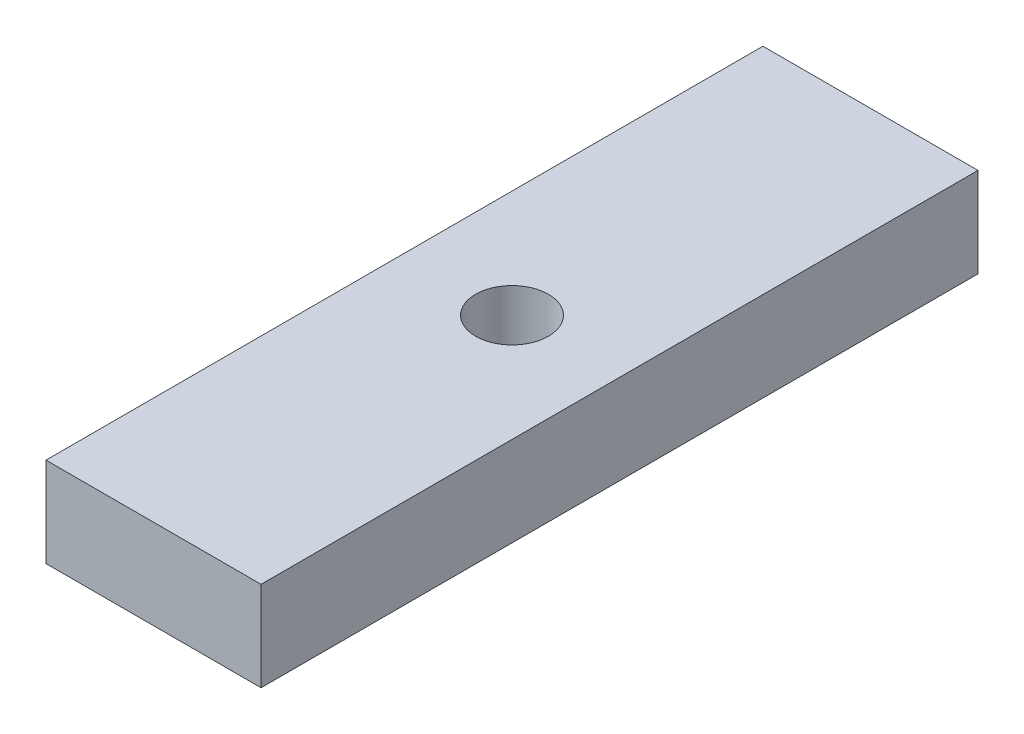
ISO-10303-21;
HEADER;
FILE_DESCRIPTION(('STEP AP214'),'2;1');
FILE_NAME('part.step','',(''),(''),'','','');
FILE_SCHEMA(('AUTOMOTIVE_DESIGN { 1 0 10303 214 1 1 1 1 }'));
ENDSEC;
DATA;
#1=APPLICATION_CONTEXT('core data for automotive mechanical design processes');
#2=APPLICATION_PROTOCOL_DEFINITION('international standard','automotive_design',2000,#1);
#3=PRODUCT_CONTEXT('',#1,'mechanical');
#4=PRODUCT('Part','Part','',(#3));
#5=PRODUCT_RELATED_PRODUCT_CATEGORY('part','',(#4));
#6=PRODUCT_DEFINITION_FORMATION('','',#4);
#7=PRODUCT_DEFINITION_CONTEXT('part definition',#1,'design');
#8=PRODUCT_DEFINITION('design','',#6,#7);
#9=PRODUCT_DEFINITION_SHAPE('','',#8);
#10=(LENGTH_UNIT() NAMED_UNIT(*) SI_UNIT(.MILLI.,.METRE.));
#11=(NAMED_UNIT(*) PLANE_ANGLE_UNIT() SI_UNIT($,.RADIAN.));
#12=(NAMED_UNIT(*) SI_UNIT($,.STERADIAN.) SOLID_ANGLE_UNIT());
#13=UNCERTAINTY_MEASURE_WITH_UNIT(LENGTH_MEASURE(1.E-05),#10,'distance_accuracy_value','');
#14=(GEOMETRIC_REPRESENTATION_CONTEXT(3) GLOBAL_UNCERTAINTY_ASSIGNED_CONTEXT((#13)) GLOBAL_UNIT_ASSIGNED_CONTEXT((#10,
#11,#12)) REPRESENTATION_CONTEXT('',''));
#15=CARTESIAN_POINT('',(0.,0.,0.));
#16=DIRECTION('',(0.,0.,1.));
#17=DIRECTION('',(1.,0.,0.));
#18=AXIS2_PLACEMENT_3D('',#15,#16,#17);
#19=CARTESIAN_POINT('',(38.1,-15.875,127.));
#20=DIRECTION('',(-1.,0.,0.));
#21=DIRECTION('',(0.,0.,1.));
#22=AXIS2_PLACEMENT_3D('',#19,#20,#21);
#23=PLANE('',#22);
#24=DIRECTION('',(0.,1.,0.));
#25=VECTOR('',#24,1.);
#26=CARTESIAN_POINT('',(38.1,-15.875,-127.));
#27=LINE('',#26,#25);
#28=CARTESIAN_POINT('',(38.1,-15.875,-127.));
#29=VERTEX_POINT('',#28);
#30=CARTESIAN_POINT('',(38.1,15.875,-127.));
#31=VERTEX_POINT('',#30);
#32=EDGE_CURVE('E98',#29,#31,#27,.T.);
#33=ORIENTED_EDGE('',*,*,#32,.T.);
#34=DIRECTION('',(0.,0.,-1.));
#35=VECTOR('',#34,1.);
#36=CARTESIAN_POINT('',(38.1,15.875,127.));
#37=LINE('',#36,#35);
#38=CARTESIAN_POINT('',(38.1,15.875,127.));
#39=VERTEX_POINT('',#38);
#40=EDGE_CURVE('E11',#39,#31,#37,.T.);
#41=ORIENTED_EDGE('',*,*,#40,.F.);
#42=DIRECTION('',(0.,1.,0.));
#43=VECTOR('',#42,1.);
#44=CARTESIAN_POINT('',(38.1,-15.875,127.));
#45=LINE('',#44,#43);
#46=CARTESIAN_POINT('',(38.1,-15.875,127.));
#47=VERTEX_POINT('',#46);
#48=EDGE_CURVE('E85',#47,#39,#45,.T.);
#49=ORIENTED_EDGE('',*,*,#48,.F.);
#50=DIRECTION('',(0.,0.,-1.));
#51=VECTOR('',#50,1.);
#52=CARTESIAN_POINT('',(38.1,-15.875,127.));
#53=LINE('',#52,#51);
#54=EDGE_CURVE('E94',#47,#29,#53,.T.);
#55=ORIENTED_EDGE('',*,*,#54,.T.);
#56=EDGE_LOOP('',(#33,#41,#49,#55));
#57=FACE_BOUND('',#56,.T.);
#58=ADVANCED_FACE('F33',(#57),#23,.F.);
#59=CARTESIAN_POINT('',(-38.1,15.875,127.));
#60=DIRECTION('',(0.,-1.,0.));
#61=DIRECTION('',(0.,0.,-1.));
#62=AXIS2_PLACEMENT_3D('',#59,#60,#61);
#63=PLANE('',#62);
#64=CARTESIAN_POINT('',(0.,15.875,0.));
#65=DIRECTION('',(0.,1.,0.));
#66=DIRECTION('',(0.,0.,1.));
#67=AXIS2_PLACEMENT_3D('',#64,#65,#66);
#68=CIRCLE('',#67,12.89812);
#69=CARTESIAN_POINT('',(0.,15.875,12.89812));
#70=VERTEX_POINT('',#69);
#71=EDGE_CURVE('E114',#70,#70,#68,.T.);
#72=ORIENTED_EDGE('',*,*,#71,.F.);
#73=EDGE_LOOP('',(#72));
#74=FACE_BOUND('',#73,.T.);
#75=DIRECTION('',(-1.,0.,0.));
#76=VECTOR('',#75,1.);
#77=CARTESIAN_POINT('',(-38.1,15.875,-127.));
#78=LINE('',#77,#76);
#79=CARTESIAN_POINT('',(-38.1,15.875,-127.));
#80=VERTEX_POINT('',#79);
#81=EDGE_CURVE('E89',#31,#80,#78,.T.);
#82=ORIENTED_EDGE('',*,*,#81,.T.);
#83=DIRECTION('',(0.,0.,-1.));
#84=VECTOR('',#83,1.);
#85=CARTESIAN_POINT('',(-38.1,15.875,127.));
#86=LINE('',#85,#84);
#87=CARTESIAN_POINT('',(-38.1,15.875,127.));
#88=VERTEX_POINT('',#87);
#89=EDGE_CURVE('E42',#88,#80,#86,.T.);
#90=ORIENTED_EDGE('',*,*,#89,.F.);
#91=DIRECTION('',(-1.,0.,0.));
#92=VECTOR('',#91,1.);
#93=CARTESIAN_POINT('',(-38.1,15.875,127.));
#94=LINE('',#93,#92);
#95=EDGE_CURVE('E80',#39,#88,#94,.T.);
#96=ORIENTED_EDGE('',*,*,#95,.F.);
#97=ORIENTED_EDGE('',*,*,#40,.T.);
#98=EDGE_LOOP('',(#82,#90,#96,#97));
#99=FACE_BOUND('',#98,.T.);
#100=ADVANCED_FACE('F88',(#74,#99),#63,.F.);
#101=CARTESIAN_POINT('',(-38.1,-15.875,127.));
#102=DIRECTION('',(1.,0.,0.));
#103=DIRECTION('',(0.,0.,-1.));
#104=AXIS2_PLACEMENT_3D('',#101,#102,#103);
#105=PLANE('',#104);
#106=DIRECTION('',(0.,-1.,0.));
#107=VECTOR('',#106,1.);
#108=CARTESIAN_POINT('',(-38.1,-15.875,-127.));
#109=LINE('',#108,#107);
#110=CARTESIAN_POINT('',(-38.1,-15.875,-127.));
#111=VERTEX_POINT('',#110);
#112=EDGE_CURVE('E67',#80,#111,#109,.T.);
#113=ORIENTED_EDGE('',*,*,#112,.T.);
#114=DIRECTION('',(0.,0.,-1.));
#115=VECTOR('',#114,1.);
#116=CARTESIAN_POINT('',(-38.1,-15.875,127.));
#117=LINE('',#116,#115);
#118=CARTESIAN_POINT('',(-38.1,-15.875,127.));
#119=VERTEX_POINT('',#118);
#120=EDGE_CURVE('E90',#119,#111,#117,.T.);
#121=ORIENTED_EDGE('',*,*,#120,.F.);
#122=DIRECTION('',(0.,-1.,0.));
#123=VECTOR('',#122,1.);
#124=CARTESIAN_POINT('',(-38.1,-15.875,127.));
#125=LINE('',#124,#123);
#126=EDGE_CURVE('E83',#88,#119,#125,.T.);
#127=ORIENTED_EDGE('',*,*,#126,.F.);
#128=ORIENTED_EDGE('',*,*,#89,.T.);
#129=EDGE_LOOP('',(#113,#121,#127,#128));
#130=FACE_BOUND('',#129,.T.);
#131=ADVANCED_FACE('F92',(#130),#105,.F.);
#132=CARTESIAN_POINT('',(-38.1,-15.875,127.));
#133=DIRECTION('',(0.,1.,0.));
#134=DIRECTION('',(0.,0.,1.));
#135=AXIS2_PLACEMENT_3D('',#132,#133,#134);
#136=PLANE('',#135);
#137=CARTESIAN_POINT('',(0.,-15.875,0.));
#138=DIRECTION('',(0.,1.,0.));
#139=DIRECTION('',(0.,0.,1.));
#140=AXIS2_PLACEMENT_3D('',#137,#138,#139);
#141=CIRCLE('',#140,0.00494685023054251);
#142=CARTESIAN_POINT('',(0.,-15.875,0.00494685023057026));
#143=VERTEX_POINT('',#142);
#144=EDGE_CURVE('E36',#143,#143,#141,.T.);
#145=ORIENTED_EDGE('',*,*,#144,.T.);
#146=EDGE_LOOP('',(#145));
#147=FACE_BOUND('',#146,.T.);
#148=DIRECTION('',(1.,0.,0.));
#149=VECTOR('',#148,1.);
#150=CARTESIAN_POINT('',(-38.1,-15.875,-127.));
#151=LINE('',#150,#149);
#152=EDGE_CURVE('E73',#111,#29,#151,.T.);
#153=ORIENTED_EDGE('',*,*,#152,.T.);
#154=ORIENTED_EDGE('',*,*,#54,.F.);
#155=DIRECTION('',(1.,0.,0.));
#156=VECTOR('',#155,1.);
#157=CARTESIAN_POINT('',(-38.1,-15.875,127.));
#158=LINE('',#157,#156);
#159=EDGE_CURVE('E50',#119,#47,#158,.T.);
#160=ORIENTED_EDGE('',*,*,#159,.F.);
#161=ORIENTED_EDGE('',*,*,#120,.T.);
#162=EDGE_LOOP('',(#153,#154,#160,#161));
#163=FACE_BOUND('',#162,.T.);
#164=ADVANCED_FACE('F105',(#147,#163),#136,.F.);
#165=CARTESIAN_POINT('',(38.1,15.875,127.));
#166=DIRECTION('',(0.,0.,-1.));
#167=DIRECTION('',(-1.,0.,0.));
#168=AXIS2_PLACEMENT_3D('',#165,#166,#167);
#169=PLANE('',#168);
#170=ORIENTED_EDGE('',*,*,#48,.T.);
#171=ORIENTED_EDGE('',*,*,#95,.T.);
#172=ORIENTED_EDGE('',*,*,#126,.T.);
#173=ORIENTED_EDGE('',*,*,#159,.T.);
#174=EDGE_LOOP('',(#170,#171,#172,#173));
#175=FACE_BOUND('',#174,.T.);
#176=ADVANCED_FACE('F81',(#175),#169,.F.);
#177=CARTESIAN_POINT('',(38.1,15.875,-127.));
#178=DIRECTION('',(0.,0.,-1.));
#179=DIRECTION('',(-1.,0.,0.));
#180=AXIS2_PLACEMENT_3D('',#177,#178,#179);
#181=PLANE('',#180);
#182=ORIENTED_EDGE('',*,*,#32,.F.);
#183=ORIENTED_EDGE('',*,*,#152,.F.);
#184=ORIENTED_EDGE('',*,*,#112,.F.);
#185=ORIENTED_EDGE('',*,*,#81,.F.);
#186=EDGE_LOOP('',(#182,#183,#184,#185));
#187=FACE_BOUND('',#186,.T.);
#188=ADVANCED_FACE('F108',(#187),#181,.T.);
#189=CARTESIAN_POINT('',(0.,-8.128,0.));
#190=DIRECTION('',(0.,1.,0.));
#191=DIRECTION('',(0.,0.,1.));
#192=AXIS2_PLACEMENT_3D('',#189,#190,#191);
#193=CONICAL_SURFACE('',#192,12.89812,1.02974425867665);
#194=CARTESIAN_POINT('',(0.,-8.128,0.));
#195=DIRECTION('',(0.,1.,0.));
#196=DIRECTION('',(0.,0.,1.));
#197=AXIS2_PLACEMENT_3D('',#194,#195,#196);
#198=CIRCLE('',#197,12.89812);
#199=CARTESIAN_POINT('',(0.,-8.128,12.89812));
#200=VERTEX_POINT('',#199);
#201=EDGE_CURVE('E111',#200,#200,#198,.T.);
#202=ORIENTED_EDGE('',*,*,#201,.T.);
#203=EDGE_LOOP('',(#202));
#204=FACE_BOUND('',#203,.T.);
#205=ORIENTED_EDGE('',*,*,#144,.F.);
#206=EDGE_LOOP('',(#205));
#207=FACE_BOUND('',#206,.T.);
#208=ADVANCED_FACE('F132',(#204,#207),#193,.F.);
#209=CARTESIAN_POINT('',(0.,15.875,0.));
#210=DIRECTION('',(0.,1.,0.));
#211=DIRECTION('',(0.,0.,1.));
#212=AXIS2_PLACEMENT_3D('',#209,#210,#211);
#213=CYLINDRICAL_SURFACE('',#212,12.89812);
#214=ORIENTED_EDGE('',*,*,#201,.F.);
#215=EDGE_LOOP('',(#214));
#216=FACE_BOUND('',#215,.T.);
#217=ORIENTED_EDGE('',*,*,#71,.T.);
#218=EDGE_LOOP('',(#217));
#219=FACE_BOUND('',#218,.T.);
#220=ADVANCED_FACE('F118',(#216,#219),#213,.F.);
#221=CLOSED_SHELL('',(#58,#100,#131,#164,#176,#188,#208,#220));
#222=MANIFOLD_SOLID_BREP('B2',#221);
#223=ADVANCED_BREP_SHAPE_REPRESENTATION('',(#18,#222),#14);
#224=SHAPE_DEFINITION_REPRESENTATION(#9,#223);
ENDSEC;
END-ISO-10303-21;
